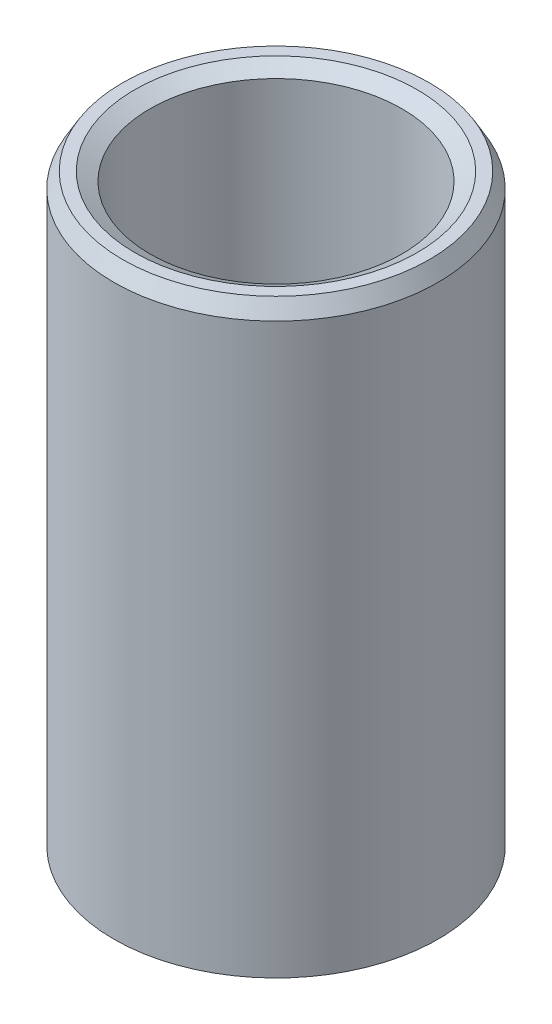
ISO-10303-21;
HEADER;
FILE_DESCRIPTION(('STEP AP214'),'2;1');
FILE_NAME('part.step','',(''),(''),'','','');
FILE_SCHEMA(('AUTOMOTIVE_DESIGN { 1 0 10303 214 1 1 1 1 }'));
ENDSEC;
DATA;
#1=APPLICATION_CONTEXT('core data for automotive mechanical design processes');
#2=APPLICATION_PROTOCOL_DEFINITION('international standard','automotive_design',2000,#1);
#3=PRODUCT_CONTEXT('',#1,'mechanical');
#4=PRODUCT('Part','Part','',(#3));
#5=PRODUCT_RELATED_PRODUCT_CATEGORY('part','',(#4));
#6=PRODUCT_DEFINITION_FORMATION('','',#4);
#7=PRODUCT_DEFINITION_CONTEXT('part definition',#1,'design');
#8=PRODUCT_DEFINITION('design','',#6,#7);
#9=PRODUCT_DEFINITION_SHAPE('','',#8);
#10=(LENGTH_UNIT() NAMED_UNIT(*) SI_UNIT(.MILLI.,.METRE.));
#11=(NAMED_UNIT(*) PLANE_ANGLE_UNIT() SI_UNIT($,.RADIAN.));
#12=(NAMED_UNIT(*) SI_UNIT($,.STERADIAN.) SOLID_ANGLE_UNIT());
#13=UNCERTAINTY_MEASURE_WITH_UNIT(LENGTH_MEASURE(1.E-05),#10,'distance_accuracy_value','');
#14=(GEOMETRIC_REPRESENTATION_CONTEXT(3) GLOBAL_UNCERTAINTY_ASSIGNED_CONTEXT((#13)) GLOBAL_UNIT_ASSIGNED_CONTEXT((#10,
#11,#12)) REPRESENTATION_CONTEXT('',''));
#15=CARTESIAN_POINT('',(0.,0.,0.));
#16=DIRECTION('',(0.,0.,1.));
#17=DIRECTION('',(1.,0.,0.));
#18=AXIS2_PLACEMENT_3D('',#15,#16,#17);
#19=CARTESIAN_POINT('',(0.,54.8676948503447,0.));
#20=DIRECTION('',(0.,-1.,0.));
#21=DIRECTION('',(0.,0.,-1.));
#22=AXIS2_PLACEMENT_3D('',#19,#20,#21);
#23=CYLINDRICAL_SURFACE('',#22,15.);
#24=CARTESIAN_POINT('',(0.,0.817305694148264,0.));
#25=DIRECTION('',(0.,1.,0.));
#26=DIRECTION('',(0.,0.,1.));
#27=AXIS2_PLACEMENT_3D('',#24,#25,#26);
#28=CIRCLE('',#27,15.);
#29=CARTESIAN_POINT('',(0.,0.817305694148257,-15.));
#30=VERTEX_POINT('',#29);
#31=EDGE_CURVE('E10',#30,#30,#28,.T.);
#32=CARTESIAN_POINT('',(0.,53.4520798627646,0.));
#33=DIRECTION('',(0.,1.,0.));
#34=DIRECTION('',(0.,0.,1.));
#35=AXIS2_PLACEMENT_3D('',#32,#33,#34);
#36=CIRCLE('',#35,15.);
#37=CARTESIAN_POINT('',(0.,53.4520798627646,-15.));
#38=VERTEX_POINT('',#37);
#39=EDGE_CURVE('E50',#38,#38,#36,.F.);
#40=CARTESIAN_POINT('',(0.,0.817305694148257,-15.));
#41=CARTESIAN_POINT('',(0.,1.36558459173801,-15.));
#42=CARTESIAN_POINT('',(0.,1.91386348932777,-15.));
#43=CARTESIAN_POINT('',(0.,3.01042128450727,-15.));
#44=CARTESIAN_POINT('',(0.,3.55870018209703,-15.));
#45=CARTESIAN_POINT('',(0.,4.65525797727654,-15.));
#46=CARTESIAN_POINT('',(0.,5.20353687486629,-15.));
#47=CARTESIAN_POINT('',(0.,6.3000946700458,-15.));
#48=CARTESIAN_POINT('',(0.,6.84837356763555,-15.));
#49=CARTESIAN_POINT('',(0.,7.94493136281506,-15.));
#50=CARTESIAN_POINT('',(0.,8.49321026040482,-15.));
#51=CARTESIAN_POINT('',(0.,9.58976805558432,-15.));
#52=CARTESIAN_POINT('',(0.,10.1380469531741,-15.));
#53=CARTESIAN_POINT('',(0.,11.2346047483536,-15.));
#54=CARTESIAN_POINT('',(0.,11.7828836459433,-15.));
#55=CARTESIAN_POINT('',(0.,12.8794414411228,-15.));
#56=CARTESIAN_POINT('',(0.,13.4277203387126,-15.));
#57=CARTESIAN_POINT('',(0.,14.5242781338921,-15.));
#58=CARTESIAN_POINT('',(0.,15.0725570314819,-15.));
#59=CARTESIAN_POINT('',(0.,16.1691148266614,-15.));
#60=CARTESIAN_POINT('',(0.,16.7173937242511,-15.));
#61=CARTESIAN_POINT('',(0.,17.8139515194306,-15.));
#62=CARTESIAN_POINT('',(0.,18.3622304170204,-15.));
#63=CARTESIAN_POINT('',(0.,19.4587882121999,-15.));
#64=CARTESIAN_POINT('',(0.,20.0070671097896,-15.));
#65=CARTESIAN_POINT('',(0.,21.1036249049692,-15.));
#66=CARTESIAN_POINT('',(0.,21.6519038025589,-15.));
#67=CARTESIAN_POINT('',(0.,22.7484615977384,-15.));
#68=CARTESIAN_POINT('',(0.,23.2967404953282,-15.));
#69=CARTESIAN_POINT('',(0.,24.3932982905077,-15.));
#70=CARTESIAN_POINT('',(0.,24.9415771880974,-15.));
#71=CARTESIAN_POINT('',(0.,26.0381349832769,-15.));
#72=CARTESIAN_POINT('',(0.,26.5864138808667,-15.));
#73=CARTESIAN_POINT('',(0.,27.6829716760462,-15.));
#74=CARTESIAN_POINT('',(0.,28.231250573636,-15.));
#75=CARTESIAN_POINT('',(0.,29.3278083688155,-15.));
#76=CARTESIAN_POINT('',(0.,29.8760872664052,-15.));
#77=CARTESIAN_POINT('',(0.,30.9726450615847,-15.));
#78=CARTESIAN_POINT('',(0.,31.5209239591745,-15.));
#79=CARTESIAN_POINT('',(0.,32.617481754354,-15.));
#80=CARTESIAN_POINT('',(0.,33.1657606519437,-15.));
#81=CARTESIAN_POINT('',(0.,34.2623184471232,-15.));
#82=CARTESIAN_POINT('',(0.,34.810597344713,-15.));
#83=CARTESIAN_POINT('',(0.,35.9071551398925,-15.));
#84=CARTESIAN_POINT('',(0.,36.4554340374823,-15.));
#85=CARTESIAN_POINT('',(0.,37.5519918326618,-15.));
#86=CARTESIAN_POINT('',(0.,38.1002707302515,-15.));
#87=CARTESIAN_POINT('',(0.,39.196828525431,-15.));
#88=CARTESIAN_POINT('',(0.,39.7451074230208,-15.));
#89=CARTESIAN_POINT('',(0.,40.8416652182003,-15.));
#90=CARTESIAN_POINT('',(0.,41.38994411579,-15.));
#91=CARTESIAN_POINT('',(0.,42.4865019109695,-15.));
#92=CARTESIAN_POINT('',(0.,43.0347808085593,-15.));
#93=CARTESIAN_POINT('',(0.,44.1313386037388,-15.));
#94=CARTESIAN_POINT('',(0.,44.6796175013286,-15.));
#95=CARTESIAN_POINT('',(0.,45.7761752965081,-15.));
#96=CARTESIAN_POINT('',(0.,46.3244541940978,-15.));
#97=CARTESIAN_POINT('',(0.,47.4210119892773,-15.));
#98=CARTESIAN_POINT('',(0.,47.9692908868671,-15.));
#99=CARTESIAN_POINT('',(0.,49.0658486820466,-15.));
#100=CARTESIAN_POINT('',(0.,49.6141275796364,-15.));
#101=CARTESIAN_POINT('',(0.,50.7106853748159,-15.));
#102=CARTESIAN_POINT('',(0.,51.2589642724056,-15.));
#103=CARTESIAN_POINT('',(0.,52.3555220675851,-15.));
#104=CARTESIAN_POINT('',(0.,52.9038009651749,-15.));
#105=CARTESIAN_POINT('',(0.,53.4520798627646,-15.));
#106=B_SPLINE_CURVE_WITH_KNOTS('',3,(#40,#41,#42,#43,#44,#45,#46,#47,#48,#49,#50,#51,#52,#53,
#54,#55,#56,#57,#58,#59,#60,#61,#62,#63,#64,#65,#66,#67,#68,#69,#70,#71,#72,#73,#74,#75,#76,#77,
#78,#79,#80,#81,#82,#83,#84,#85,#86,#87,#88,#89,#90,#91,#92,#93,#94,#95,#96,#97,#98,#99,#100,
#101,#102,#103,#104,#105),.UNSPECIFIED.,.F.,.F.,(4,2,2,2,2,2,2,2,2,2,2,2,2,2,2,2,2,2,2,2,2,2,2,
2,2,2,2,2,2,2,2,2,4),(0.,1.64483669276926,3.28967338553852,4.93451007830779,6.57934677107705,
8.22418346384631,9.86902015661557,11.5138568493848,13.1586935421541,14.8035302349234,
16.4483669276926,18.0932036204619,19.7380403132311,21.3828770060004,23.0277136987697,
24.6725503915389,26.3173870843082,27.9622237770774,29.6070604698467,31.251897162616,
32.8967338553852,34.5415705481545,36.1864072409238,37.831243933693,39.4760806264623,
41.1209173192315,42.7657540120008,44.4105907047701,46.0554273975393,47.7002640903086,
49.3451007830778,50.9899374758471,52.6347741686164),.UNSPECIFIED.);
#107=EDGE_CURVE('BSEAM39',#30,#38,#106,.T.);
#108=ORIENTED_EDGE('',*,*,#31,.T.);
#109=ORIENTED_EDGE('',*,*,#39,.T.);
#110=ORIENTED_EDGE('',*,*,#107,.T.);
#111=ORIENTED_EDGE('',*,*,#107,.F.);
#112=EDGE_LOOP('',(#108,#110,#109,#111));
#113=FACE_BOUND('',#112,.T.);
#114=ADVANCED_FACE('F39',(#113),#23,.T.);
#115=CARTESIAN_POINT('',(0.,54.8676948503447,0.));
#116=DIRECTION('',(0.,1.,0.));
#117=DIRECTION('',(0.,0.,1.));
#118=AXIS2_PLACEMENT_3D('',#115,#116,#117);
#119=PLANE('',#118);
#120=CARTESIAN_POINT('',(0.,54.8676948503447,0.));
#121=DIRECTION('',(0.,1.,0.));
#122=DIRECTION('',(0.,0.,1.));
#123=AXIS2_PLACEMENT_3D('',#120,#121,#122);
#124=CIRCLE('',#123,13.0666918123218);
#125=CARTESIAN_POINT('',(0.,54.8676948503447,13.0666918123218));
#126=VERTEX_POINT('',#125);
#127=EDGE_CURVE('E58',#126,#126,#124,.F.);
#128=ORIENTED_EDGE('',*,*,#127,.T.);
#129=EDGE_LOOP('',(#128));
#130=FACE_BOUND('',#129,.T.);
#131=CARTESIAN_POINT('',(0.,54.8676948503447,0.));
#132=DIRECTION('',(0.,1.,0.));
#133=DIRECTION('',(0.,0.,1.));
#134=AXIS2_PLACEMENT_3D('',#131,#132,#133);
#135=CIRCLE('',#134,14.1826943058518);
#136=CARTESIAN_POINT('',(0.,54.8676948503447,14.1826943058518));
#137=VERTEX_POINT('',#136);
#138=EDGE_CURVE('E61',#137,#137,#135,.T.);
#139=ORIENTED_EDGE('',*,*,#138,.T.);
#140=EDGE_LOOP('',(#139));
#141=FACE_BOUND('',#140,.T.);
#142=ADVANCED_FACE('F88',(#130,#141),#119,.T.);
#143=CARTESIAN_POINT('',(0.,0.,0.));
#144=DIRECTION('',(0.,1.,0.));
#145=DIRECTION('',(0.,0.,1.));
#146=AXIS2_PLACEMENT_3D('',#143,#144,#145);
#147=PLANE('',#146);
#148=CARTESIAN_POINT('',(0.,0.,0.));
#149=DIRECTION('',(0.,1.,0.));
#150=DIRECTION('',(0.,0.,1.));
#151=AXIS2_PLACEMENT_3D('',#148,#149,#150);
#152=CIRCLE('',#151,12.4683825188899);
#153=CARTESIAN_POINT('',(0.,0.,12.4683825188899));
#154=VERTEX_POINT('',#153);
#155=EDGE_CURVE('E51',#154,#154,#152,.T.);
#156=ORIENTED_EDGE('',*,*,#155,.T.);
#157=EDGE_LOOP('',(#156));
#158=FACE_BOUND('',#157,.T.);
#159=CARTESIAN_POINT('',(0.,0.,0.));
#160=DIRECTION('',(0.,1.,0.));
#161=DIRECTION('',(0.,0.,1.));
#162=AXIS2_PLACEMENT_3D('',#159,#160,#161);
#163=CIRCLE('',#162,13.5843850124199);
#164=CARTESIAN_POINT('',(0.,0.,13.5843850124199));
#165=VERTEX_POINT('',#164);
#166=EDGE_CURVE('E54',#165,#165,#163,.F.);
#167=ORIENTED_EDGE('',*,*,#166,.T.);
#168=EDGE_LOOP('',(#167));
#169=FACE_BOUND('',#168,.T.);
#170=ADVANCED_FACE('F83',(#158,#169),#147,.F.);
#171=CARTESIAN_POINT('',(0.,54.8676948503447,0.));
#172=DIRECTION('',(0.,-1.,0.));
#173=DIRECTION('',(0.,0.,-1.));
#174=AXIS2_PLACEMENT_3D('',#171,#172,#173);
#175=CYLINDRICAL_SURFACE('',#174,11.6510768247416);
#176=CARTESIAN_POINT('',(0.,54.0503891561964,0.));
#177=DIRECTION('',(0.,1.,0.));
#178=DIRECTION('',(0.,0.,1.));
#179=AXIS2_PLACEMENT_3D('',#176,#177,#178);
#180=CIRCLE('',#179,11.6510768247416);
#181=CARTESIAN_POINT('',(0.,54.0503891561964,-11.6510768247416));
#182=VERTEX_POINT('',#181);
#183=EDGE_CURVE('E67',#182,#182,#180,.T.);
#184=CARTESIAN_POINT('',(0.,1.41561498758013,0.));
#185=DIRECTION('',(0.,1.,0.));
#186=DIRECTION('',(0.,0.,1.));
#187=AXIS2_PLACEMENT_3D('',#184,#185,#186);
#188=CIRCLE('',#187,11.6510768247416);
#189=CARTESIAN_POINT('',(0.,1.41561498758012,-11.6510768247416));
#190=VERTEX_POINT('',#189);
#191=EDGE_CURVE('E69',#190,#190,#188,.F.);
#192=CARTESIAN_POINT('',(0.,54.0503891561964,-11.6510768247416));
#193=CARTESIAN_POINT('',(0.,53.5021102586067,-11.6510768247416));
#194=CARTESIAN_POINT('',(0.,52.9538313610169,-11.6510768247416));
#195=CARTESIAN_POINT('',(0.,51.8572735658374,-11.6510768247416));
#196=CARTESIAN_POINT('',(0.,51.3089946682477,-11.6510768247416));
#197=CARTESIAN_POINT('',(0.,50.2124368730682,-11.6510768247416));
#198=CARTESIAN_POINT('',(0.,49.6641579754784,-11.6510768247416));
#199=CARTESIAN_POINT('',(0.,48.5676001802989,-11.6510768247416));
#200=CARTESIAN_POINT('',(0.,48.0193212827092,-11.6510768247416));
#201=CARTESIAN_POINT('',(0.,46.9227634875297,-11.6510768247416));
#202=CARTESIAN_POINT('',(0.,46.3744845899399,-11.6510768247416));
#203=CARTESIAN_POINT('',(0.,45.2779267947604,-11.6510768247416));
#204=CARTESIAN_POINT('',(0.,44.7296478971706,-11.6510768247416));
#205=CARTESIAN_POINT('',(0.,43.6330901019911,-11.6510768247416));
#206=CARTESIAN_POINT('',(0.,43.0848112044014,-11.6510768247416));
#207=CARTESIAN_POINT('',(0.,41.9882534092219,-11.6510768247416));
#208=CARTESIAN_POINT('',(0.,41.4399745116321,-11.6510768247416));
#209=CARTESIAN_POINT('',(0.,40.3434167164526,-11.6510768247416));
#210=CARTESIAN_POINT('',(0.,39.7951378188628,-11.6510768247416));
#211=CARTESIAN_POINT('',(0.,38.6985800236833,-11.6510768247416));
#212=CARTESIAN_POINT('',(0.,38.1503011260936,-11.6510768247416));
#213=CARTESIAN_POINT('',(0.,37.0537433309141,-11.6510768247416));
#214=CARTESIAN_POINT('',(0.,36.5054644333243,-11.6510768247416));
#215=CARTESIAN_POINT('',(0.,35.4089066381448,-11.6510768247416));
#216=CARTESIAN_POINT('',(0.,34.8606277405551,-11.6510768247416));
#217=CARTESIAN_POINT('',(0.,33.7640699453756,-11.6510768247416));
#218=CARTESIAN_POINT('',(0.,33.2157910477858,-11.6510768247416));
#219=CARTESIAN_POINT('',(0.,32.1192332526063,-11.6510768247416));
#220=CARTESIAN_POINT('',(0.,31.5709543550166,-11.6510768247416));
#221=CARTESIAN_POINT('',(0.,30.474396559837,-11.6510768247416));
#222=CARTESIAN_POINT('',(0.,29.9261176622473,-11.6510768247416));
#223=CARTESIAN_POINT('',(0.,28.8295598670678,-11.6510768247416));
#224=CARTESIAN_POINT('',(0.,28.281280969478,-11.6510768247416));
#225=CARTESIAN_POINT('',(0.,27.1847231742985,-11.6510768247416));
#226=CARTESIAN_POINT('',(0.,26.6364442767088,-11.6510768247416));
#227=CARTESIAN_POINT('',(0.,25.5398864815293,-11.6510768247416));
#228=CARTESIAN_POINT('',(0.,24.9916075839395,-11.6510768247416));
#229=CARTESIAN_POINT('',(0.,23.89504978876,-11.6510768247416));
#230=CARTESIAN_POINT('',(0.,23.3467708911703,-11.6510768247416));
#231=CARTESIAN_POINT('',(0.,22.2502130959907,-11.6510768247416));
#232=CARTESIAN_POINT('',(0.,21.701934198401,-11.6510768247416));
#233=CARTESIAN_POINT('',(0.,20.6053764032215,-11.6510768247416));
#234=CARTESIAN_POINT('',(0.,20.0570975056317,-11.6510768247416));
#235=CARTESIAN_POINT('',(0.,18.9605397104522,-11.6510768247416));
#236=CARTESIAN_POINT('',(0.,18.4122608128625,-11.6510768247416));
#237=CARTESIAN_POINT('',(0.,17.315703017683,-11.6510768247416));
#238=CARTESIAN_POINT('',(0.,16.7674241200932,-11.6510768247416));
#239=CARTESIAN_POINT('',(0.,15.6708663249137,-11.6510768247416));
#240=CARTESIAN_POINT('',(0.,15.122587427324,-11.6510768247416));
#241=CARTESIAN_POINT('',(0.,14.0260296321445,-11.6510768247416));
#242=CARTESIAN_POINT('',(0.,13.4777507345547,-11.6510768247416));
#243=CARTESIAN_POINT('',(0.,12.3811929393752,-11.6510768247416));
#244=CARTESIAN_POINT('',(0.,11.8329140417854,-11.6510768247416));
#245=CARTESIAN_POINT('',(0.,10.7363562466059,-11.6510768247416));
#246=CARTESIAN_POINT('',(0.,10.1880773490162,-11.6510768247416));
#247=CARTESIAN_POINT('',(0.,9.09151955383666,-11.6510768247416));
#248=CARTESIAN_POINT('',(0.,8.54324065624691,-11.6510768247416));
#249=CARTESIAN_POINT('',(0.,7.44668286106741,-11.6510768247416));
#250=CARTESIAN_POINT('',(0.,6.89840396347766,-11.6510768247416));
#251=CARTESIAN_POINT('',(0.,5.80184616829815,-11.6510768247416));
#252=CARTESIAN_POINT('',(0.,5.25356727070839,-11.6510768247416));
#253=CARTESIAN_POINT('',(0.,4.15700947552888,-11.6510768247416));
#254=CARTESIAN_POINT('',(0.,3.60873057793913,-11.6510768247416));
#255=CARTESIAN_POINT('',(0.,2.51217278275963,-11.6510768247416));
#256=CARTESIAN_POINT('',(0.,1.96389388516988,-11.6510768247416));
#257=CARTESIAN_POINT('',(0.,1.41561498758012,-11.6510768247416));
#258=B_SPLINE_CURVE_WITH_KNOTS('',3,(#192,#193,#194,#195,#196,#197,#198,#199,#200,#201,#202,
#203,#204,#205,#206,#207,#208,#209,#210,#211,#212,#213,#214,#215,#216,#217,#218,#219,#220,#221,
#222,#223,#224,#225,#226,#227,#228,#229,#230,#231,#232,#233,#234,#235,#236,#237,#238,#239,#240,
#241,#242,#243,#244,#245,#246,#247,#248,#249,#250,#251,#252,#253,#254,#255,#256,#257),
.UNSPECIFIED.,.F.,.F.,(4,2,2,2,2,2,2,2,2,2,2,2,2,2,2,2,2,2,2,2,2,2,2,2,2,2,2,2,2,2,2,2,4),(0.,
1.64483669276926,3.28967338553852,4.93451007830778,6.57934677107704,8.22418346384631,
9.86902015661556,11.5138568493848,13.1586935421541,14.8035302349233,16.4483669276926,
18.0932036204619,19.7380403132311,21.3828770060004,23.0277136987696,24.6725503915389,
26.3173870843082,27.9622237770774,29.6070604698467,31.2518971626159,32.8967338553852,
34.5415705481545,36.1864072409237,37.831243933693,39.4760806264622,41.1209173192315,
42.7657540120008,44.41059070477,46.0554273975393,47.7002640903085,49.3451007830778,
50.9899374758471,52.6347741686163),.UNSPECIFIED.);
#259=EDGE_CURVE('BSEAM71',#182,#190,#258,.T.);
#260=ORIENTED_EDGE('',*,*,#183,.T.);
#261=ORIENTED_EDGE('',*,*,#191,.T.);
#262=ORIENTED_EDGE('',*,*,#259,.T.);
#263=ORIENTED_EDGE('',*,*,#259,.F.);
#264=EDGE_LOOP('',(#260,#262,#261,#263));
#265=FACE_BOUND('',#264,.T.);
#266=ADVANCED_FACE('F71',(#265),#175,.F.);
#267=CARTESIAN_POINT('',(0.,54.0503891561964,0.));
#268=DIRECTION('',(0.,1.,0.));
#269=DIRECTION('',(0.,0.,1.));
#270=AXIS2_PLACEMENT_3D('',#267,#268,#269);
#271=CONICAL_SURFACE('',#270,11.6510768247416,1.0471975511966);
#272=ORIENTED_EDGE('',*,*,#127,.F.);
#273=EDGE_LOOP('',(#272));
#274=FACE_BOUND('',#273,.T.);
#275=ORIENTED_EDGE('',*,*,#183,.F.);
#276=EDGE_LOOP('',(#275));
#277=FACE_BOUND('',#276,.T.);
#278=ADVANCED_FACE('F77',(#274,#277),#271,.F.);
#279=CARTESIAN_POINT('',(0.,0.,0.));
#280=DIRECTION('',(0.,-1.,0.));
#281=DIRECTION('',(0.,0.,-1.));
#282=AXIS2_PLACEMENT_3D('',#279,#280,#281);
#283=CONICAL_SURFACE('',#282,12.4683825188899,0.52359877559829);
#284=ORIENTED_EDGE('',*,*,#191,.F.);
#285=EDGE_LOOP('',(#284));
#286=FACE_BOUND('',#285,.T.);
#287=ORIENTED_EDGE('',*,*,#155,.F.);
#288=EDGE_LOOP('',(#287));
#289=FACE_BOUND('',#288,.T.);
#290=ADVANCED_FACE('F73',(#286,#289),#283,.F.);
#291=CARTESIAN_POINT('',(0.,0.817305694148264,0.));
#292=DIRECTION('',(0.,1.,0.));
#293=DIRECTION('',(0.,0.,1.));
#294=AXIS2_PLACEMENT_3D('',#291,#292,#293);
#295=CONICAL_SURFACE('',#294,15.,1.0471975511966);
#296=ORIENTED_EDGE('',*,*,#166,.F.);
#297=EDGE_LOOP('',(#296));
#298=FACE_BOUND('',#297,.T.);
#299=ORIENTED_EDGE('',*,*,#31,.F.);
#300=EDGE_LOOP('',(#299));
#301=FACE_BOUND('',#300,.T.);
#302=ADVANCED_FACE('F76',(#298,#301),#295,.T.);
#303=CARTESIAN_POINT('',(0.,54.8676948503447,0.));
#304=DIRECTION('',(0.,-1.,0.));
#305=DIRECTION('',(0.,0.,-1.));
#306=AXIS2_PLACEMENT_3D('',#303,#304,#305);
#307=CONICAL_SURFACE('',#306,14.1826943058518,0.523598775598292);
#308=ORIENTED_EDGE('',*,*,#39,.F.);
#309=EDGE_LOOP('',(#308));
#310=FACE_BOUND('',#309,.T.);
#311=ORIENTED_EDGE('',*,*,#138,.F.);
#312=EDGE_LOOP('',(#311));
#313=FACE_BOUND('',#312,.T.);
#314=ADVANCED_FACE('F45',(#310,#313),#307,.T.);
#315=CLOSED_SHELL('',(#114,#142,#170,#266,#278,#290,#302,#314));
#316=MANIFOLD_SOLID_BREP('B2',#315);
#317=ADVANCED_BREP_SHAPE_REPRESENTATION('',(#18,#316),#14);
#318=SHAPE_DEFINITION_REPRESENTATION(#9,#317);
ENDSEC;
END-ISO-10303-21;
